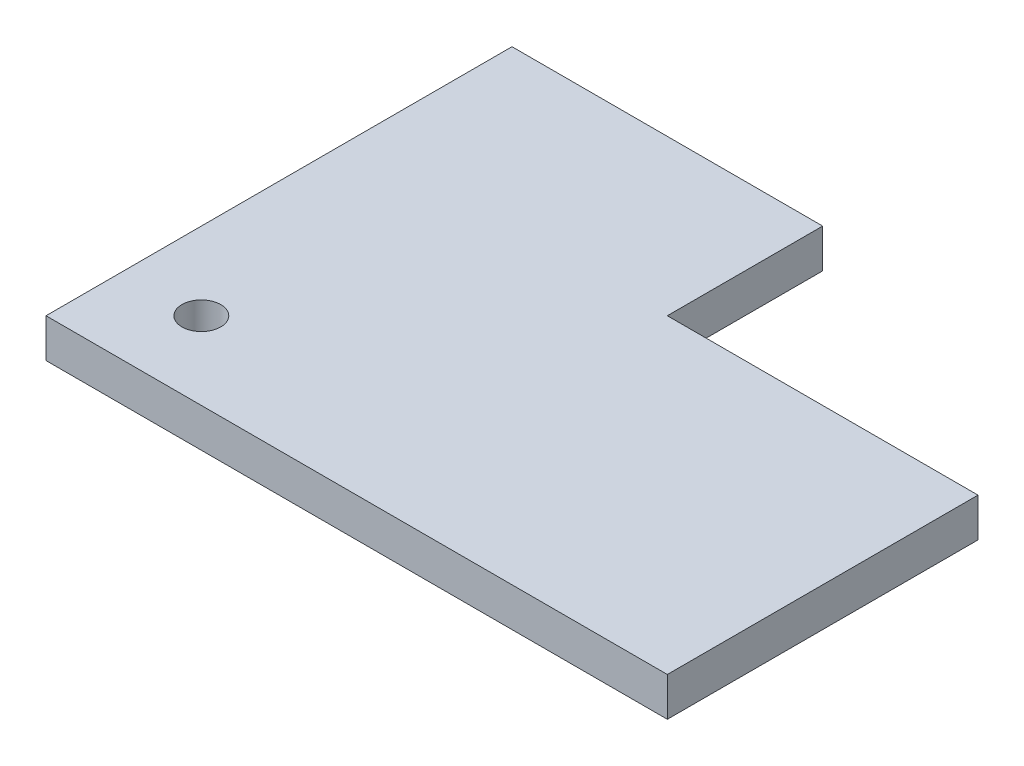
ISO-10303-21;
HEADER;
FILE_DESCRIPTION(('STEP AP214'),'2;1');
FILE_NAME('part.step','',(''),(''),'','','');
FILE_SCHEMA(('AUTOMOTIVE_DESIGN { 1 0 10303 214 1 1 1 1 }'));
ENDSEC;
DATA;
#1=APPLICATION_CONTEXT('core data for automotive mechanical design processes');
#2=APPLICATION_PROTOCOL_DEFINITION('international standard','automotive_design',2000,#1);
#3=PRODUCT_CONTEXT('',#1,'mechanical');
#4=PRODUCT('Part','Part','',(#3));
#5=PRODUCT_RELATED_PRODUCT_CATEGORY('part','',(#4));
#6=PRODUCT_DEFINITION_FORMATION('','',#4);
#7=PRODUCT_DEFINITION_CONTEXT('part definition',#1,'design');
#8=PRODUCT_DEFINITION('design','',#6,#7);
#9=PRODUCT_DEFINITION_SHAPE('','',#8);
#10=(LENGTH_UNIT() NAMED_UNIT(*) SI_UNIT(.MILLI.,.METRE.));
#11=(NAMED_UNIT(*) PLANE_ANGLE_UNIT() SI_UNIT($,.RADIAN.));
#12=(NAMED_UNIT(*) SI_UNIT($,.STERADIAN.) SOLID_ANGLE_UNIT());
#13=UNCERTAINTY_MEASURE_WITH_UNIT(LENGTH_MEASURE(1.E-05),#10,'distance_accuracy_value','');
#14=(GEOMETRIC_REPRESENTATION_CONTEXT(3) GLOBAL_UNCERTAINTY_ASSIGNED_CONTEXT((#13)) GLOBAL_UNIT_ASSIGNED_CONTEXT((#10,
#11,#12)) REPRESENTATION_CONTEXT('',''));
#15=CARTESIAN_POINT('',(0.,0.,0.));
#16=DIRECTION('',(0.,0.,1.));
#17=DIRECTION('',(1.,0.,0.));
#18=AXIS2_PLACEMENT_3D('',#15,#16,#17);
#19=CARTESIAN_POINT('',(800.,50.,0.));
#20=DIRECTION('',(0.,0.,-1.));
#21=DIRECTION('',(-1.,0.,0.));
#22=AXIS2_PLACEMENT_3D('',#19,#20,#21);
#23=PLANE('',#22);
#24=DIRECTION('',(1.,0.,0.));
#25=VECTOR('',#24,1.);
#26=CARTESIAN_POINT('',(800.,0.,0.));
#27=LINE('',#26,#25);
#28=CARTESIAN_POINT('',(0.,0.,0.));
#29=VERTEX_POINT('',#28);
#30=CARTESIAN_POINT('',(800.,0.,0.));
#31=VERTEX_POINT('',#30);
#32=EDGE_CURVE('E116',#29,#31,#27,.T.);
#33=ORIENTED_EDGE('',*,*,#32,.T.);
#34=DIRECTION('',(0.,-1.,0.));
#35=VECTOR('',#34,1.);
#36=CARTESIAN_POINT('',(800.,50.,0.));
#37=LINE('',#36,#35);
#38=CARTESIAN_POINT('',(800.,50.,0.));
#39=VERTEX_POINT('',#38);
#40=EDGE_CURVE('E11',#39,#31,#37,.T.);
#41=ORIENTED_EDGE('',*,*,#40,.F.);
#42=DIRECTION('',(1.,0.,0.));
#43=VECTOR('',#42,1.);
#44=CARTESIAN_POINT('',(800.,50.,0.));
#45=LINE('',#44,#43);
#46=CARTESIAN_POINT('',(0.,50.,0.));
#47=VERTEX_POINT('',#46);
#48=EDGE_CURVE('E127',#47,#39,#45,.T.);
#49=ORIENTED_EDGE('',*,*,#48,.F.);
#50=DIRECTION('',(0.,-1.,0.));
#51=VECTOR('',#50,1.);
#52=CARTESIAN_POINT('',(0.,50.,0.));
#53=LINE('',#52,#51);
#54=EDGE_CURVE('E112',#47,#29,#53,.T.);
#55=ORIENTED_EDGE('',*,*,#54,.T.);
#56=EDGE_LOOP('',(#33,#41,#49,#55));
#57=FACE_BOUND('',#56,.T.);
#58=ADVANCED_FACE('F32',(#57),#23,.F.);
#59=CARTESIAN_POINT('',(800.,50.,-400.));
#60=DIRECTION('',(-1.,0.,0.));
#61=DIRECTION('',(0.,0.,1.));
#62=AXIS2_PLACEMENT_3D('',#59,#60,#61);
#63=PLANE('',#62);
#64=DIRECTION('',(0.,0.,-1.));
#65=VECTOR('',#64,1.);
#66=CARTESIAN_POINT('',(800.,0.,-400.));
#67=LINE('',#66,#65);
#68=CARTESIAN_POINT('',(800.,0.,-400.));
#69=VERTEX_POINT('',#68);
#70=EDGE_CURVE('E119',#31,#69,#67,.T.);
#71=ORIENTED_EDGE('',*,*,#70,.T.);
#72=DIRECTION('',(0.,-1.,0.));
#73=VECTOR('',#72,1.);
#74=CARTESIAN_POINT('',(800.,50.,-400.));
#75=LINE('',#74,#73);
#76=CARTESIAN_POINT('',(800.,50.,-400.));
#77=VERTEX_POINT('',#76);
#78=EDGE_CURVE('E40',#77,#69,#75,.T.);
#79=ORIENTED_EDGE('',*,*,#78,.F.);
#80=DIRECTION('',(0.,0.,-1.));
#81=VECTOR('',#80,1.);
#82=CARTESIAN_POINT('',(800.,50.,-400.));
#83=LINE('',#82,#81);
#84=EDGE_CURVE('E85',#39,#77,#83,.T.);
#85=ORIENTED_EDGE('',*,*,#84,.F.);
#86=ORIENTED_EDGE('',*,*,#40,.T.);
#87=EDGE_LOOP('',(#71,#79,#85,#86));
#88=FACE_BOUND('',#87,.T.);
#89=ADVANCED_FACE('F152',(#88),#63,.F.);
#90=CARTESIAN_POINT('',(400.,50.,-400.));
#91=DIRECTION('',(0.,0.,1.));
#92=DIRECTION('',(1.,0.,0.));
#93=AXIS2_PLACEMENT_3D('',#90,#91,#92);
#94=PLANE('',#93);
#95=DIRECTION('',(-1.,0.,0.));
#96=VECTOR('',#95,1.);
#97=CARTESIAN_POINT('',(400.,0.,-400.));
#98=LINE('',#97,#96);
#99=CARTESIAN_POINT('',(400.,0.,-400.));
#100=VERTEX_POINT('',#99);
#101=EDGE_CURVE('E122',#69,#100,#98,.T.);
#102=ORIENTED_EDGE('',*,*,#101,.T.);
#103=DIRECTION('',(0.,-1.,0.));
#104=VECTOR('',#103,1.);
#105=CARTESIAN_POINT('',(400.,50.,-400.));
#106=LINE('',#105,#104);
#107=CARTESIAN_POINT('',(400.,50.,-400.));
#108=VERTEX_POINT('',#107);
#109=EDGE_CURVE('E107',#108,#100,#106,.T.);
#110=ORIENTED_EDGE('',*,*,#109,.F.);
#111=DIRECTION('',(-1.,0.,0.));
#112=VECTOR('',#111,1.);
#113=CARTESIAN_POINT('',(400.,50.,-400.));
#114=LINE('',#113,#112);
#115=EDGE_CURVE('E98',#77,#108,#114,.T.);
#116=ORIENTED_EDGE('',*,*,#115,.F.);
#117=ORIENTED_EDGE('',*,*,#78,.T.);
#118=EDGE_LOOP('',(#102,#110,#116,#117));
#119=FACE_BOUND('',#118,.T.);
#120=ADVANCED_FACE('F133',(#119),#94,.F.);
#121=CARTESIAN_POINT('',(400.,50.,-600.));
#122=DIRECTION('',(-1.,0.,0.));
#123=DIRECTION('',(0.,0.,1.));
#124=AXIS2_PLACEMENT_3D('',#121,#122,#123);
#125=PLANE('',#124);
#126=DIRECTION('',(0.,0.,-1.));
#127=VECTOR('',#126,1.);
#128=CARTESIAN_POINT('',(400.,0.,-600.));
#129=LINE('',#128,#127);
#130=CARTESIAN_POINT('',(400.,0.,-600.));
#131=VERTEX_POINT('',#130);
#132=EDGE_CURVE('E106',#100,#131,#129,.T.);
#133=ORIENTED_EDGE('',*,*,#132,.T.);
#134=DIRECTION('',(0.,-1.,0.));
#135=VECTOR('',#134,1.);
#136=CARTESIAN_POINT('',(400.,50.,-600.));
#137=LINE('',#136,#135);
#138=CARTESIAN_POINT('',(400.,50.,-600.));
#139=VERTEX_POINT('',#138);
#140=EDGE_CURVE('E103',#139,#131,#137,.T.);
#141=ORIENTED_EDGE('',*,*,#140,.F.);
#142=DIRECTION('',(0.,0.,-1.));
#143=VECTOR('',#142,1.);
#144=CARTESIAN_POINT('',(400.,50.,-600.));
#145=LINE('',#144,#143);
#146=EDGE_CURVE('E92',#108,#139,#145,.T.);
#147=ORIENTED_EDGE('',*,*,#146,.F.);
#148=ORIENTED_EDGE('',*,*,#109,.T.);
#149=EDGE_LOOP('',(#133,#141,#147,#148));
#150=FACE_BOUND('',#149,.T.);
#151=ADVANCED_FACE('F104',(#150),#125,.F.);
#152=CARTESIAN_POINT('',(0.,50.,-600.));
#153=DIRECTION('',(0.,0.,1.));
#154=DIRECTION('',(1.,0.,0.));
#155=AXIS2_PLACEMENT_3D('',#152,#153,#154);
#156=PLANE('',#155);
#157=DIRECTION('',(-1.,0.,0.));
#158=VECTOR('',#157,1.);
#159=CARTESIAN_POINT('',(0.,0.,-600.));
#160=LINE('',#159,#158);
#161=CARTESIAN_POINT('',(0.,0.,-600.));
#162=VERTEX_POINT('',#161);
#163=EDGE_CURVE('E71',#131,#162,#160,.T.);
#164=ORIENTED_EDGE('',*,*,#163,.T.);
#165=DIRECTION('',(0.,-1.,0.));
#166=VECTOR('',#165,1.);
#167=CARTESIAN_POINT('',(0.,50.,-600.));
#168=LINE('',#167,#166);
#169=CARTESIAN_POINT('',(0.,50.,-600.));
#170=VERTEX_POINT('',#169);
#171=EDGE_CURVE('E108',#170,#162,#168,.T.);
#172=ORIENTED_EDGE('',*,*,#171,.F.);
#173=DIRECTION('',(-1.,0.,0.));
#174=VECTOR('',#173,1.);
#175=CARTESIAN_POINT('',(0.,50.,-600.));
#176=LINE('',#175,#174);
#177=EDGE_CURVE('E96',#139,#170,#176,.T.);
#178=ORIENTED_EDGE('',*,*,#177,.F.);
#179=ORIENTED_EDGE('',*,*,#140,.T.);
#180=EDGE_LOOP('',(#164,#172,#178,#179));
#181=FACE_BOUND('',#180,.T.);
#182=ADVANCED_FACE('F110',(#181),#156,.F.);
#183=CARTESIAN_POINT('',(0.,50.,0.));
#184=DIRECTION('',(1.,0.,0.));
#185=DIRECTION('',(0.,0.,-1.));
#186=AXIS2_PLACEMENT_3D('',#183,#184,#185);
#187=PLANE('',#186);
#188=DIRECTION('',(0.,0.,1.));
#189=VECTOR('',#188,1.);
#190=CARTESIAN_POINT('',(0.,0.,0.));
#191=LINE('',#190,#189);
#192=EDGE_CURVE('E77',#162,#29,#191,.T.);
#193=ORIENTED_EDGE('',*,*,#192,.T.);
#194=ORIENTED_EDGE('',*,*,#54,.F.);
#195=DIRECTION('',(0.,0.,1.));
#196=VECTOR('',#195,1.);
#197=CARTESIAN_POINT('',(0.,50.,0.));
#198=LINE('',#197,#196);
#199=EDGE_CURVE('E48',#170,#47,#198,.T.);
#200=ORIENTED_EDGE('',*,*,#199,.F.);
#201=ORIENTED_EDGE('',*,*,#171,.T.);
#202=EDGE_LOOP('',(#193,#194,#200,#201));
#203=FACE_BOUND('',#202,.T.);
#204=ADVANCED_FACE('F140',(#203),#187,.F.);
#205=CARTESIAN_POINT('',(0.,50.,0.));
#206=DIRECTION('',(0.,-1.,0.));
#207=DIRECTION('',(0.,0.,-1.));
#208=AXIS2_PLACEMENT_3D('',#205,#206,#207);
#209=PLANE('',#208);
#210=CARTESIAN_POINT('',(100.,50.,-100.));
#211=DIRECTION('',(0.,1.,0.));
#212=DIRECTION('',(0.,0.,1.));
#213=AXIS2_PLACEMENT_3D('',#210,#211,#212);
#214=CIRCLE('',#213,25.);
#215=CARTESIAN_POINT('',(100.,50.,-75.));
#216=VERTEX_POINT('',#215);
#217=EDGE_CURVE('E207',#216,#216,#214,.T.);
#218=ORIENTED_EDGE('',*,*,#217,.F.);
#219=EDGE_LOOP('',(#218));
#220=FACE_BOUND('',#219,.T.);
#221=ORIENTED_EDGE('',*,*,#48,.T.);
#222=ORIENTED_EDGE('',*,*,#84,.T.);
#223=ORIENTED_EDGE('',*,*,#115,.T.);
#224=ORIENTED_EDGE('',*,*,#146,.T.);
#225=ORIENTED_EDGE('',*,*,#177,.T.);
#226=ORIENTED_EDGE('',*,*,#199,.T.);
#227=EDGE_LOOP('',(#221,#222,#223,#224,#225,#226));
#228=FACE_BOUND('',#227,.T.);
#229=ADVANCED_FACE('F94',(#220,#228),#209,.F.);
#230=CARTESIAN_POINT('',(0.,0.,0.));
#231=DIRECTION('',(0.,-1.,0.));
#232=DIRECTION('',(0.,0.,-1.));
#233=AXIS2_PLACEMENT_3D('',#230,#231,#232);
#234=PLANE('',#233);
#235=CARTESIAN_POINT('',(100.,0.,-100.));
#236=DIRECTION('',(0.,1.,0.));
#237=DIRECTION('',(0.,0.,1.));
#238=AXIS2_PLACEMENT_3D('',#235,#236,#237);
#239=CIRCLE('',#238,25.);
#240=CARTESIAN_POINT('',(100.,0.,-75.));
#241=VERTEX_POINT('',#240);
#242=EDGE_CURVE('E120',#241,#241,#239,.T.);
#243=ORIENTED_EDGE('',*,*,#242,.T.);
#244=EDGE_LOOP('',(#243));
#245=FACE_BOUND('',#244,.T.);
#246=ORIENTED_EDGE('',*,*,#32,.F.);
#247=ORIENTED_EDGE('',*,*,#192,.F.);
#248=ORIENTED_EDGE('',*,*,#163,.F.);
#249=ORIENTED_EDGE('',*,*,#132,.F.);
#250=ORIENTED_EDGE('',*,*,#101,.F.);
#251=ORIENTED_EDGE('',*,*,#70,.F.);
#252=EDGE_LOOP('',(#246,#247,#248,#249,#250,#251));
#253=FACE_BOUND('',#252,.T.);
#254=ADVANCED_FACE('F136',(#245,#253),#234,.T.);
#255=CARTESIAN_POINT('',(100.,0.,-100.));
#256=DIRECTION('',(0.,1.,0.));
#257=DIRECTION('',(0.,0.,1.));
#258=AXIS2_PLACEMENT_3D('',#255,#256,#257);
#259=CYLINDRICAL_SURFACE('',#258,25.);
#260=ORIENTED_EDGE('',*,*,#242,.F.);
#261=EDGE_LOOP('',(#260));
#262=FACE_BOUND('',#261,.T.);
#263=ORIENTED_EDGE('',*,*,#217,.T.);
#264=EDGE_LOOP('',(#263));
#265=FACE_BOUND('',#264,.T.);
#266=ADVANCED_FACE('F189',(#262,#265),#259,.F.);
#267=CLOSED_SHELL('',(#58,#89,#120,#151,#182,#204,#229,#254,#266));
#268=MANIFOLD_SOLID_BREP('B2',#267);
#269=ADVANCED_BREP_SHAPE_REPRESENTATION('',(#18,#268),#14);
#270=SHAPE_DEFINITION_REPRESENTATION(#9,#269);
ENDSEC;
END-ISO-10303-21;
